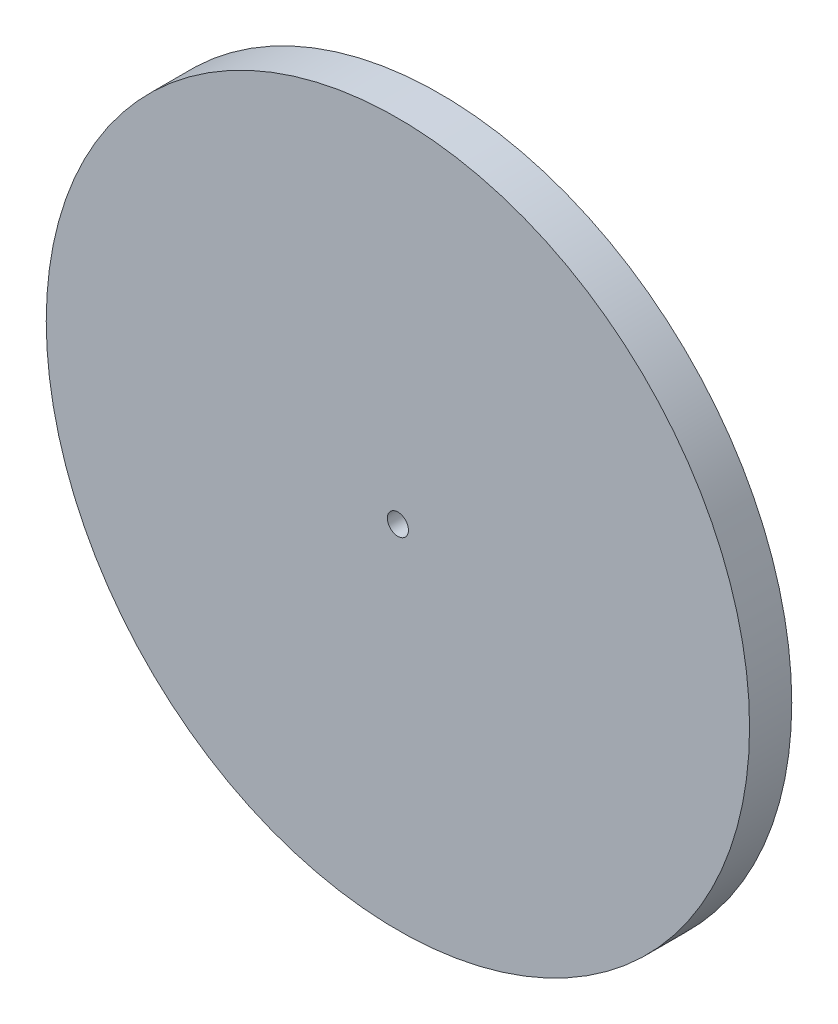
ISO-10303-21;
HEADER;
FILE_DESCRIPTION(('STEP AP214'),'2;1');
FILE_NAME('part.step','',(''),(''),'','','');
FILE_SCHEMA(('AUTOMOTIVE_DESIGN { 1 0 10303 214 1 1 1 1 }'));
ENDSEC;
DATA;
#1=APPLICATION_CONTEXT('core data for automotive mechanical design processes');
#2=APPLICATION_PROTOCOL_DEFINITION('international standard','automotive_design',2000,#1);
#3=PRODUCT_CONTEXT('',#1,'mechanical');
#4=PRODUCT('Part','Part','',(#3));
#5=PRODUCT_RELATED_PRODUCT_CATEGORY('part','',(#4));
#6=PRODUCT_DEFINITION_FORMATION('','',#4);
#7=PRODUCT_DEFINITION_CONTEXT('part definition',#1,'design');
#8=PRODUCT_DEFINITION('design','',#6,#7);
#9=PRODUCT_DEFINITION_SHAPE('','',#8);
#10=(LENGTH_UNIT() NAMED_UNIT(*) SI_UNIT(.MILLI.,.METRE.));
#11=(NAMED_UNIT(*) PLANE_ANGLE_UNIT() SI_UNIT($,.RADIAN.));
#12=(NAMED_UNIT(*) SI_UNIT($,.STERADIAN.) SOLID_ANGLE_UNIT());
#13=UNCERTAINTY_MEASURE_WITH_UNIT(LENGTH_MEASURE(1.E-05),#10,'distance_accuracy_value','');
#14=(GEOMETRIC_REPRESENTATION_CONTEXT(3) GLOBAL_UNCERTAINTY_ASSIGNED_CONTEXT((#13)) GLOBAL_UNIT_ASSIGNED_CONTEXT((#10,
#11,#12)) REPRESENTATION_CONTEXT('',''));
#15=CARTESIAN_POINT('',(0.,0.,0.));
#16=DIRECTION('',(0.,0.,1.));
#17=DIRECTION('',(1.,0.,0.));
#18=AXIS2_PLACEMENT_3D('',#15,#16,#17);
#19=CARTESIAN_POINT('',(0.,0.,3.));
#20=DIRECTION('',(0.,0.,1.));
#21=DIRECTION('',(1.,0.,0.));
#22=AXIS2_PLACEMENT_3D('',#19,#20,#21);
#23=PLANE('',#22);
#24=CARTESIAN_POINT('',(0.,0.,3.));
#25=DIRECTION('',(0.,0.,1.));
#26=DIRECTION('',(1.,0.,0.));
#27=AXIS2_PLACEMENT_3D('',#24,#25,#26);
#28=CIRCLE('',#27,25.);
#29=CARTESIAN_POINT('',(25.,0.,3.));
#30=VERTEX_POINT('',#29);
#31=EDGE_CURVE('E10',#30,#30,#28,.T.);
#32=ORIENTED_EDGE('',*,*,#31,.T.);
#33=EDGE_LOOP('',(#32));
#34=FACE_BOUND('',#33,.T.);
#35=CARTESIAN_POINT('',(0.,0.,3.));
#36=DIRECTION('',(0.,0.,1.));
#37=DIRECTION('',(1.,0.,0.));
#38=AXIS2_PLACEMENT_3D('',#35,#36,#37);
#39=CIRCLE('',#38,0.75);
#40=CARTESIAN_POINT('',(0.75,0.,3.));
#41=VERTEX_POINT('',#40);
#42=EDGE_CURVE('E50',#41,#41,#39,.T.);
#43=ORIENTED_EDGE('',*,*,#42,.F.);
#44=EDGE_LOOP('',(#43));
#45=FACE_BOUND('',#44,.T.);
#46=ADVANCED_FACE('F37',(#34,#45),#23,.T.);
#47=CARTESIAN_POINT('',(0.,0.,0.));
#48=DIRECTION('',(0.,0.,1.));
#49=DIRECTION('',(1.,0.,0.));
#50=AXIS2_PLACEMENT_3D('',#47,#48,#49);
#51=PLANE('',#50);
#52=CARTESIAN_POINT('',(0.,0.,0.));
#53=DIRECTION('',(0.,0.,1.));
#54=DIRECTION('',(1.,0.,0.));
#55=AXIS2_PLACEMENT_3D('',#52,#53,#54);
#56=CIRCLE('',#55,25.);
#57=CARTESIAN_POINT('',(25.,0.,0.));
#58=VERTEX_POINT('',#57);
#59=EDGE_CURVE('E41',#58,#58,#56,.T.);
#60=ORIENTED_EDGE('',*,*,#59,.F.);
#61=EDGE_LOOP('',(#60));
#62=FACE_BOUND('',#61,.T.);
#63=CARTESIAN_POINT('',(0.,0.,0.));
#64=DIRECTION('',(0.,0.,1.));
#65=DIRECTION('',(1.,0.,0.));
#66=AXIS2_PLACEMENT_3D('',#63,#64,#65);
#67=CIRCLE('',#66,0.75);
#68=CARTESIAN_POINT('',(0.75,0.,0.));
#69=VERTEX_POINT('',#68);
#70=EDGE_CURVE('E52',#69,#69,#67,.T.);
#71=ORIENTED_EDGE('',*,*,#70,.T.);
#72=EDGE_LOOP('',(#71));
#73=FACE_BOUND('',#72,.T.);
#74=ADVANCED_FACE('F64',(#62,#73),#51,.F.);
#75=CARTESIAN_POINT('',(0.,0.,3.));
#76=DIRECTION('',(0.,0.,-1.));
#77=DIRECTION('',(-1.,0.,0.));
#78=AXIS2_PLACEMENT_3D('',#75,#76,#77);
#79=CYLINDRICAL_SURFACE('',#78,25.);
#80=ORIENTED_EDGE('',*,*,#31,.F.);
#81=EDGE_LOOP('',(#80));
#82=FACE_BOUND('',#81,.T.);
#83=ORIENTED_EDGE('',*,*,#59,.T.);
#84=EDGE_LOOP('',(#83));
#85=FACE_BOUND('',#84,.T.);
#86=ADVANCED_FACE('F39',(#82,#85),#79,.T.);
#87=CARTESIAN_POINT('',(0.,0.,3.));
#88=DIRECTION('',(0.,0.,-1.));
#89=DIRECTION('',(-1.,0.,0.));
#90=AXIS2_PLACEMENT_3D('',#87,#88,#89);
#91=CYLINDRICAL_SURFACE('',#90,0.75);
#92=ORIENTED_EDGE('',*,*,#42,.T.);
#93=EDGE_LOOP('',(#92));
#94=FACE_BOUND('',#93,.T.);
#95=ORIENTED_EDGE('',*,*,#70,.F.);
#96=EDGE_LOOP('',(#95));
#97=FACE_BOUND('',#96,.T.);
#98=ADVANCED_FACE('F60',(#94,#97),#91,.F.);
#99=CLOSED_SHELL('',(#46,#74,#86,#98));
#100=MANIFOLD_SOLID_BREP('B2',#99);
#101=ADVANCED_BREP_SHAPE_REPRESENTATION('',(#18,#100),#14);
#102=SHAPE_DEFINITION_REPRESENTATION(#9,#101);
ENDSEC;
END-ISO-10303-21;
